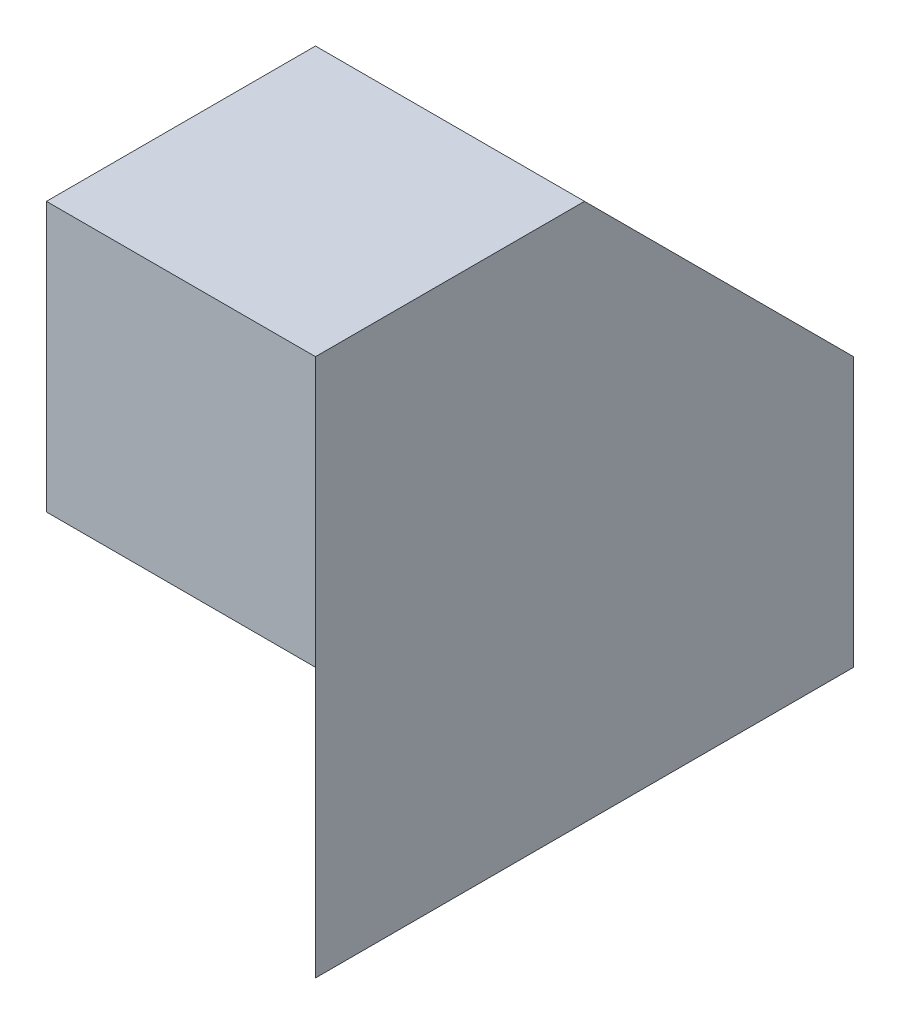
ISO-10303-21;
HEADER;
FILE_DESCRIPTION(('STEP AP214'),'2;1');
FILE_NAME('part.step','',(''),(''),'','','');
FILE_SCHEMA(('AUTOMOTIVE_DESIGN { 1 0 10303 214 1 1 1 1 }'));
ENDSEC;
DATA;
#1=APPLICATION_CONTEXT('core data for automotive mechanical design processes');
#2=APPLICATION_PROTOCOL_DEFINITION('international standard','automotive_design',2000,#1);
#3=PRODUCT_CONTEXT('',#1,'mechanical');
#4=PRODUCT('Part','Part','',(#3));
#5=PRODUCT_RELATED_PRODUCT_CATEGORY('part','',(#4));
#6=PRODUCT_DEFINITION_FORMATION('','',#4);
#7=PRODUCT_DEFINITION_CONTEXT('part definition',#1,'design');
#8=PRODUCT_DEFINITION('design','',#6,#7);
#9=PRODUCT_DEFINITION_SHAPE('','',#8);
#10=(LENGTH_UNIT() NAMED_UNIT(*) SI_UNIT(.MILLI.,.METRE.));
#11=(NAMED_UNIT(*) PLANE_ANGLE_UNIT() SI_UNIT($,.RADIAN.));
#12=(NAMED_UNIT(*) SI_UNIT($,.STERADIAN.) SOLID_ANGLE_UNIT());
#13=UNCERTAINTY_MEASURE_WITH_UNIT(LENGTH_MEASURE(1.E-05),#10,'distance_accuracy_value','');
#14=(GEOMETRIC_REPRESENTATION_CONTEXT(3) GLOBAL_UNCERTAINTY_ASSIGNED_CONTEXT((#13)) GLOBAL_UNIT_ASSIGNED_CONTEXT((#10,
#11,#12)) REPRESENTATION_CONTEXT('',''));
#15=CARTESIAN_POINT('',(0.,0.,0.));
#16=DIRECTION('',(0.,0.,1.));
#17=DIRECTION('',(1.,0.,0.));
#18=AXIS2_PLACEMENT_3D('',#15,#16,#17);
#19=CARTESIAN_POINT('',(0.,0.,40.));
#20=DIRECTION('',(0.,1.,0.));
#21=DIRECTION('',(0.,0.,1.));
#22=AXIS2_PLACEMENT_3D('',#19,#20,#21);
#23=PLANE('',#22);
#24=DIRECTION('',(0.,0.,-1.));
#25=VECTOR('',#24,1.);
#26=CARTESIAN_POINT('',(40.,0.,40.));
#27=LINE('',#26,#25);
#28=CARTESIAN_POINT('',(40.,0.,40.));
#29=VERTEX_POINT('',#28);
#30=CARTESIAN_POINT('',(40.,0.,0.));
#31=VERTEX_POINT('',#30);
#32=EDGE_CURVE('E41',#29,#31,#27,.T.);
#33=ORIENTED_EDGE('',*,*,#32,.F.);
#34=DIRECTION('',(-0.707106781186548,0.,-0.707106781186548));
#35=VECTOR('',#34,1.);
#36=CARTESIAN_POINT('',(20.,0.,20.));
#37=LINE('',#36,#35);
#38=CARTESIAN_POINT('',(0.,0.,0.));
#39=VERTEX_POINT('',#38);
#40=EDGE_CURVE('E145',#29,#39,#37,.T.);
#41=ORIENTED_EDGE('',*,*,#40,.T.);
#42=DIRECTION('',(1.,0.,0.));
#43=VECTOR('',#42,1.);
#44=CARTESIAN_POINT('',(0.,0.,0.));
#45=LINE('',#44,#43);
#46=EDGE_CURVE('E110',#39,#31,#45,.T.);
#47=ORIENTED_EDGE('',*,*,#46,.T.);
#48=EDGE_LOOP('',(#33,#41,#47));
#49=FACE_BOUND('',#48,.T.);
#50=ADVANCED_FACE('F33',(#49),#23,.F.);
#51=CARTESIAN_POINT('',(40.,0.,40.));
#52=DIRECTION('',(-1.,0.,0.));
#53=DIRECTION('',(0.,0.,1.));
#54=AXIS2_PLACEMENT_3D('',#51,#52,#53);
#55=PLANE('',#54);
#56=DIRECTION('',(0.,1.,0.));
#57=VECTOR('',#56,1.);
#58=CARTESIAN_POINT('',(40.,0.,0.));
#59=LINE('',#58,#57);
#60=CARTESIAN_POINT('',(40.,20.,0.));
#61=VERTEX_POINT('',#60);
#62=EDGE_CURVE('E103',#31,#61,#59,.T.);
#63=ORIENTED_EDGE('',*,*,#62,.T.);
#64=DIRECTION('',(0.,0.707106781186548,0.707106781186548));
#65=VECTOR('',#64,1.);
#66=CARTESIAN_POINT('',(40.,20.,0.));
#67=LINE('',#66,#65);
#68=CARTESIAN_POINT('',(40.,40.,20.));
#69=VERTEX_POINT('',#68);
#70=EDGE_CURVE('E89',#61,#69,#67,.T.);
#71=ORIENTED_EDGE('',*,*,#70,.T.);
#72=DIRECTION('',(0.,0.,1.));
#73=VECTOR('',#72,1.);
#74=CARTESIAN_POINT('',(40.,40.,40.));
#75=LINE('',#74,#73);
#76=CARTESIAN_POINT('',(40.,40.,40.));
#77=VERTEX_POINT('',#76);
#78=EDGE_CURVE('E136',#69,#77,#75,.T.);
#79=ORIENTED_EDGE('',*,*,#78,.T.);
#80=DIRECTION('',(0.,-1.,0.));
#81=VECTOR('',#80,1.);
#82=CARTESIAN_POINT('',(40.,20.,40.));
#83=LINE('',#82,#81);
#84=CARTESIAN_POINT('',(40.,20.,40.));
#85=VERTEX_POINT('',#84);
#86=EDGE_CURVE('E133',#77,#85,#83,.T.);
#87=ORIENTED_EDGE('',*,*,#86,.T.);
#88=DIRECTION('',(0.,1.,0.));
#89=VECTOR('',#88,1.);
#90=CARTESIAN_POINT('',(40.,0.,40.));
#91=LINE('',#90,#89);
#92=EDGE_CURVE('E112',#29,#85,#91,.T.);
#93=ORIENTED_EDGE('',*,*,#92,.F.);
#94=ORIENTED_EDGE('',*,*,#32,.T.);
#95=EDGE_LOOP('',(#63,#71,#79,#87,#93,#94));
#96=FACE_BOUND('',#95,.T.);
#97=ADVANCED_FACE('F107',(#96),#55,.F.);
#98=CARTESIAN_POINT('',(0.,20.,40.));
#99=DIRECTION('',(0.,-1.,0.));
#100=DIRECTION('',(0.,0.,-1.));
#101=AXIS2_PLACEMENT_3D('',#98,#99,#100);
#102=PLANE('',#101);
#103=DIRECTION('',(-0.707106781186548,0.,-0.707106781186548));
#104=VECTOR('',#103,1.);
#105=CARTESIAN_POINT('',(0.,20.,0.));
#106=LINE('',#105,#104);
#107=CARTESIAN_POINT('',(20.,20.,20.));
#108=VERTEX_POINT('',#107);
#109=CARTESIAN_POINT('',(0.,20.,0.));
#110=VERTEX_POINT('',#109);
#111=EDGE_CURVE('E57',#108,#110,#106,.T.);
#112=ORIENTED_EDGE('',*,*,#111,.F.);
#113=DIRECTION('',(0.,0.,-1.));
#114=VECTOR('',#113,1.);
#115=CARTESIAN_POINT('',(20.,20.,40.));
#116=LINE('',#115,#114);
#117=CARTESIAN_POINT('',(20.,20.,0.));
#118=VERTEX_POINT('',#117);
#119=EDGE_CURVE('E11',#108,#118,#116,.T.);
#120=ORIENTED_EDGE('',*,*,#119,.T.);
#121=DIRECTION('',(-1.,0.,0.));
#122=VECTOR('',#121,1.);
#123=CARTESIAN_POINT('',(0.,20.,0.));
#124=LINE('',#123,#122);
#125=EDGE_CURVE('E105',#118,#110,#124,.T.);
#126=ORIENTED_EDGE('',*,*,#125,.T.);
#127=EDGE_LOOP('',(#112,#120,#126));
#128=FACE_BOUND('',#127,.T.);
#129=ADVANCED_FACE('F164',(#128),#102,.F.);
#130=CARTESIAN_POINT('',(0.,0.,0.));
#131=DIRECTION('',(0.,0.,-1.));
#132=DIRECTION('',(-1.,0.,0.));
#133=AXIS2_PLACEMENT_3D('',#130,#131,#132);
#134=PLANE('',#133);
#135=DIRECTION('',(-1.,0.,0.));
#136=VECTOR('',#135,1.);
#137=CARTESIAN_POINT('',(40.,20.,0.));
#138=LINE('',#137,#136);
#139=EDGE_CURVE('E49',#61,#118,#138,.T.);
#140=ORIENTED_EDGE('',*,*,#139,.F.);
#141=ORIENTED_EDGE('',*,*,#62,.F.);
#142=ORIENTED_EDGE('',*,*,#46,.F.);
#143=DIRECTION('',(0.,-1.,0.));
#144=VECTOR('',#143,1.);
#145=CARTESIAN_POINT('',(0.,0.,0.));
#146=LINE('',#145,#144);
#147=EDGE_CURVE('E114',#110,#39,#146,.T.);
#148=ORIENTED_EDGE('',*,*,#147,.F.);
#149=ORIENTED_EDGE('',*,*,#125,.F.);
#150=EDGE_LOOP('',(#140,#141,#142,#148,#149));
#151=FACE_BOUND('',#150,.T.);
#152=ADVANCED_FACE('F101',(#151),#134,.T.);
#153=CARTESIAN_POINT('',(0.,-20.,0.));
#154=DIRECTION('',(0.707106781186548,0.,-0.707106781186548));
#155=DIRECTION('',(-0.707106781186548,0.,-0.707106781186548));
#156=AXIS2_PLACEMENT_3D('',#153,#154,#155);
#157=PLANE('',#156);
#158=ORIENTED_EDGE('',*,*,#92,.T.);
#159=EDGE_CURVE('E143',#85,#108,#106,.T.);
#160=ORIENTED_EDGE('',*,*,#159,.T.);
#161=ORIENTED_EDGE('',*,*,#111,.T.);
#162=ORIENTED_EDGE('',*,*,#147,.T.);
#163=ORIENTED_EDGE('',*,*,#40,.F.);
#164=EDGE_LOOP('',(#158,#160,#161,#162,#163));
#165=FACE_BOUND('',#164,.T.);
#166=ADVANCED_FACE('F149',(#165),#157,.F.);
#167=CARTESIAN_POINT('',(20.,20.,40.));
#168=DIRECTION('',(0.,-1.,0.));
#169=DIRECTION('',(0.,0.,-1.));
#170=AXIS2_PLACEMENT_3D('',#167,#168,#169);
#171=PLANE('',#170);
#172=ORIENTED_EDGE('',*,*,#159,.F.);
#173=DIRECTION('',(1.,0.,0.));
#174=VECTOR('',#173,1.);
#175=CARTESIAN_POINT('',(20.,20.,40.));
#176=LINE('',#175,#174);
#177=CARTESIAN_POINT('',(20.,20.,40.));
#178=VERTEX_POINT('',#177);
#179=EDGE_CURVE('E132',#178,#85,#176,.T.);
#180=ORIENTED_EDGE('',*,*,#179,.F.);
#181=EDGE_CURVE('E123',#178,#108,#116,.T.);
#182=ORIENTED_EDGE('',*,*,#181,.T.);
#183=EDGE_LOOP('',(#172,#180,#182));
#184=FACE_BOUND('',#183,.T.);
#185=ADVANCED_FACE('F153',(#184),#171,.T.);
#186=CARTESIAN_POINT('',(20.,20.,40.));
#187=DIRECTION('',(0.,0.,1.));
#188=DIRECTION('',(1.,0.,0.));
#189=AXIS2_PLACEMENT_3D('',#186,#187,#188);
#190=PLANE('',#189);
#191=ORIENTED_EDGE('',*,*,#86,.F.);
#192=DIRECTION('',(1.,0.,0.));
#193=VECTOR('',#192,1.);
#194=CARTESIAN_POINT('',(20.,40.,40.));
#195=LINE('',#194,#193);
#196=CARTESIAN_POINT('',(20.,40.,40.));
#197=VERTEX_POINT('',#196);
#198=EDGE_CURVE('E138',#197,#77,#195,.T.);
#199=ORIENTED_EDGE('',*,*,#198,.F.);
#200=DIRECTION('',(0.,-1.,0.));
#201=VECTOR('',#200,1.);
#202=CARTESIAN_POINT('',(20.,20.,40.));
#203=LINE('',#202,#201);
#204=EDGE_CURVE('E129',#197,#178,#203,.T.);
#205=ORIENTED_EDGE('',*,*,#204,.T.);
#206=ORIENTED_EDGE('',*,*,#179,.T.);
#207=EDGE_LOOP('',(#191,#199,#205,#206));
#208=FACE_BOUND('',#207,.T.);
#209=ADVANCED_FACE('F157',(#208),#190,.T.);
#210=CARTESIAN_POINT('',(20.,40.,40.));
#211=DIRECTION('',(0.,1.,0.));
#212=DIRECTION('',(0.,0.,1.));
#213=AXIS2_PLACEMENT_3D('',#210,#211,#212);
#214=PLANE('',#213);
#215=DIRECTION('',(-1.,0.,0.));
#216=VECTOR('',#215,1.);
#217=CARTESIAN_POINT('',(40.,40.,20.));
#218=LINE('',#217,#216);
#219=CARTESIAN_POINT('',(20.,40.,20.));
#220=VERTEX_POINT('',#219);
#221=EDGE_CURVE('E92',#69,#220,#218,.T.);
#222=ORIENTED_EDGE('',*,*,#221,.T.);
#223=DIRECTION('',(0.,0.,1.));
#224=VECTOR('',#223,1.);
#225=CARTESIAN_POINT('',(20.,40.,40.));
#226=LINE('',#225,#224);
#227=EDGE_CURVE('E128',#220,#197,#226,.T.);
#228=ORIENTED_EDGE('',*,*,#227,.T.);
#229=ORIENTED_EDGE('',*,*,#198,.T.);
#230=ORIENTED_EDGE('',*,*,#78,.F.);
#231=EDGE_LOOP('',(#222,#228,#229,#230));
#232=FACE_BOUND('',#231,.T.);
#233=ADVANCED_FACE('F205',(#232),#214,.T.);
#234=CARTESIAN_POINT('',(20.,0.,0.));
#235=DIRECTION('',(-1.,0.,0.));
#236=DIRECTION('',(0.,0.,1.));
#237=AXIS2_PLACEMENT_3D('',#234,#235,#236);
#238=PLANE('',#237);
#239=DIRECTION('',(0.,0.707106781186548,0.707106781186548));
#240=VECTOR('',#239,1.);
#241=CARTESIAN_POINT('',(20.,20.,0.));
#242=LINE('',#241,#240);
#243=EDGE_CURVE('E96',#118,#220,#242,.T.);
#244=ORIENTED_EDGE('',*,*,#243,.F.);
#245=ORIENTED_EDGE('',*,*,#119,.F.);
#246=ORIENTED_EDGE('',*,*,#181,.F.);
#247=ORIENTED_EDGE('',*,*,#204,.F.);
#248=ORIENTED_EDGE('',*,*,#227,.F.);
#249=EDGE_LOOP('',(#244,#245,#246,#247,#248));
#250=FACE_BOUND('',#249,.T.);
#251=ADVANCED_FACE('F162',(#250),#238,.T.);
#252=CARTESIAN_POINT('',(40.,20.,0.));
#253=DIRECTION('',(0.,-0.707106781186548,0.707106781186548));
#254=DIRECTION('',(0.,-0.707106781186548,-0.707106781186548));
#255=AXIS2_PLACEMENT_3D('',#252,#253,#254);
#256=PLANE('',#255);
#257=ORIENTED_EDGE('',*,*,#243,.T.);
#258=ORIENTED_EDGE('',*,*,#221,.F.);
#259=ORIENTED_EDGE('',*,*,#70,.F.);
#260=ORIENTED_EDGE('',*,*,#139,.T.);
#261=EDGE_LOOP('',(#257,#258,#259,#260));
#262=FACE_BOUND('',#261,.T.);
#263=ADVANCED_FACE('F90',(#262),#256,.F.);
#264=CLOSED_SHELL('',(#50,#97,#129,#152,#166,#185,#209,#233,#251,#263));
#265=MANIFOLD_SOLID_BREP('B2',#264);
#266=ADVANCED_BREP_SHAPE_REPRESENTATION('',(#18,#265),#14);
#267=SHAPE_DEFINITION_REPRESENTATION(#9,#266);
ENDSEC;
END-ISO-10303-21;
